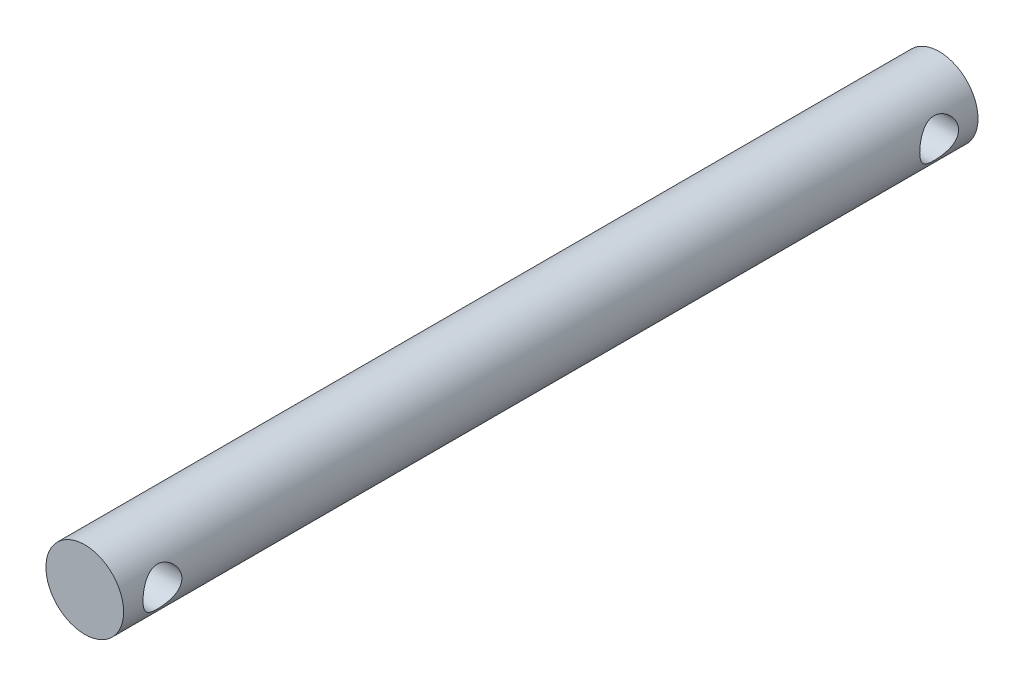
ISO-10303-21;
HEADER;
FILE_DESCRIPTION(('STEP AP214'),'2;1');
FILE_NAME('part.step','',(''),(''),'','','');
FILE_SCHEMA(('AUTOMOTIVE_DESIGN { 1 0 10303 214 1 1 1 1 }'));
ENDSEC;
DATA;
#1=APPLICATION_CONTEXT('core data for automotive mechanical design processes');
#2=APPLICATION_PROTOCOL_DEFINITION('international standard','automotive_design',2000,#1);
#3=PRODUCT_CONTEXT('',#1,'mechanical');
#4=PRODUCT('Part','Part','',(#3));
#5=PRODUCT_RELATED_PRODUCT_CATEGORY('part','',(#4));
#6=PRODUCT_DEFINITION_FORMATION('','',#4);
#7=PRODUCT_DEFINITION_CONTEXT('part definition',#1,'design');
#8=PRODUCT_DEFINITION('design','',#6,#7);
#9=PRODUCT_DEFINITION_SHAPE('','',#8);
#10=(LENGTH_UNIT() NAMED_UNIT(*) SI_UNIT(.MILLI.,.METRE.));
#11=(NAMED_UNIT(*) PLANE_ANGLE_UNIT() SI_UNIT($,.RADIAN.));
#12=(NAMED_UNIT(*) SI_UNIT($,.STERADIAN.) SOLID_ANGLE_UNIT());
#13=UNCERTAINTY_MEASURE_WITH_UNIT(LENGTH_MEASURE(1.E-05),#10,'distance_accuracy_value','');
#14=(GEOMETRIC_REPRESENTATION_CONTEXT(3) GLOBAL_UNCERTAINTY_ASSIGNED_CONTEXT((#13)) GLOBAL_UNIT_ASSIGNED_CONTEXT((#10,
#11,#12)) REPRESENTATION_CONTEXT('',''));
#15=CARTESIAN_POINT('',(0.,0.,0.));
#16=DIRECTION('',(0.,0.,1.));
#17=DIRECTION('',(1.,0.,0.));
#18=AXIS2_PLACEMENT_3D('',#15,#16,#17);
#19=CARTESIAN_POINT('',(0.,0.,33.));
#20=DIRECTION('',(0.,0.,-1.));
#21=DIRECTION('',(-1.,0.,0.));
#22=AXIS2_PLACEMENT_3D('',#19,#20,#21);
#23=CYLINDRICAL_SURFACE('',#22,3.);
#24=CARTESIAN_POINT('',(-3.,0.,-28.5));
#25=CARTESIAN_POINT('',(-2.99999570107562,-0.0788579444268505,-28.5000049534758));
#26=CARTESIAN_POINT('',(-2.99685736529635,-0.157809899546344,-28.5062551096816));
#27=CARTESIAN_POINT('',(-2.98461234055736,-0.313380352903345,-28.5309793205123));
#28=CARTESIAN_POINT('',(-2.97549431743379,-0.389994130070445,-28.5494765894967));
#29=CARTESIAN_POINT('',(-2.95224419105063,-0.538400317320674,-28.5977907129249));
#30=CARTESIAN_POINT('',(-2.93813158766306,-0.61021020440872,-28.6275635763719));
#31=CARTESIAN_POINT('',(-2.90618664773642,-0.747708925209898,-28.6973559320475));
#32=CARTESIAN_POINT('',(-2.88835460450288,-0.813398240985089,-28.7373746163733));
#33=CARTESIAN_POINT('',(-2.84934387387093,-0.941261726642865,-28.8292758742279));
#34=CARTESIAN_POINT('',(-2.82802798691306,-1.00298281668317,-28.8817297188595));
#35=CARTESIAN_POINT('',(-2.78489955370114,-1.11716916730047,-28.9957822188706));
#36=CARTESIAN_POINT('',(-2.76308664313552,-1.16962737466015,-29.0573877776587));
#37=CARTESIAN_POINT('',(-2.71948426796021,-1.26787800067542,-29.1937250242851));
#38=CARTESIAN_POINT('',(-2.69782780455198,-1.31283800332746,-29.2691041475189));
#39=CARTESIAN_POINT('',(-2.65928968158481,-1.38925234033605,-29.4275510039793));
#40=CARTESIAN_POINT('',(-2.64240461410484,-1.4207163224495,-29.5106131930841));
#41=CARTESIAN_POINT('',(-2.61686800556713,-1.46719866328289,-29.6769976581329));
#42=CARTESIAN_POINT('',(-2.6077840737557,-1.48308878562067,-29.7600066781011));
#43=CARTESIAN_POINT('',(-2.59772834922791,-1.50064048996327,-29.9279682566692));
#44=CARTESIAN_POINT('',(-2.59674854014932,-1.50231613255962,-30.0129188113067));
#45=CARTESIAN_POINT('',(-2.60266395385873,-1.49203093075845,-30.1714290364731));
#46=CARTESIAN_POINT('',(-2.6086314549302,-1.48167683930524,-30.2451360468346));
#47=CARTESIAN_POINT('',(-2.62614343100775,-1.4504097735854,-30.3895828640596));
#48=CARTESIAN_POINT('',(-2.63768968247664,-1.42949343584648,-30.460321717958));
#49=CARTESIAN_POINT('',(-2.66531214619111,-1.37731467057901,-30.5988436988485));
#50=CARTESIAN_POINT('',(-2.68148760995998,-1.345822600674,-30.6665195981787));
#51=CARTESIAN_POINT('',(-2.71655106422105,-1.27356253150201,-30.795951438885));
#52=CARTESIAN_POINT('',(-2.73544027170286,-1.2327903657187,-30.8577047034001));
#53=CARTESIAN_POINT('',(-2.77669736854929,-1.13709908236919,-30.9817818791148));
#54=CARTESIAN_POINT('',(-2.79920265355119,-1.08104168755392,-31.0431853103642));
#55=CARTESIAN_POINT('',(-2.84321434950611,-0.959333368112061,-31.1561031278864));
#56=CARTESIAN_POINT('',(-2.86472027938201,-0.893677884861429,-31.2076127880508));
#57=CARTESIAN_POINT('',(-2.90552980924446,-0.750774758747772,-31.3015284915446));
#58=CARTESIAN_POINT('',(-2.92468476243011,-0.673130387399112,-31.3434007086686));
#59=CARTESIAN_POINT('',(-2.95736821681863,-0.510699323233194,-31.4131455435645));
#60=CARTESIAN_POINT('',(-2.9709011841533,-0.425918364397913,-31.4410292775228));
#61=CARTESIAN_POINT('',(-2.98986500612153,-0.259149737491054,-31.479713105575));
#62=CARTESIAN_POINT('',(-2.99587407451965,-0.177512295822491,-31.4917368536202));
#63=CARTESIAN_POINT('',(-3.00109520188655,-0.0131693999240299,-31.5021970967017));
#64=CARTESIAN_POINT('',(-3.00031048081978,0.06953552980486,-31.5006400284592));
#65=CARTESIAN_POINT('',(-2.99236788380152,0.226849457978977,-31.4846899673719));
#66=CARTESIAN_POINT('',(-2.98570868532253,0.301589112074893,-31.471301200905));
#67=CARTESIAN_POINT('',(-2.9673325697226,0.44761033845291,-31.4336428921573));
#68=CARTESIAN_POINT('',(-2.95561509501618,0.518891528536629,-31.4093721503198));
#69=CARTESIAN_POINT('',(-2.92776377120382,0.658332912674358,-31.3500023003505));
#70=CARTESIAN_POINT('',(-2.91151322654446,0.726345595508704,-31.3146134248256));
#71=CARTESIAN_POINT('',(-2.87615961476126,0.855692042548907,-31.2343386965302));
#72=CARTESIAN_POINT('',(-2.85705533350408,0.917022944664887,-31.1894487981069));
#73=CARTESIAN_POINT('',(-2.81562332004297,1.03765153393382,-31.0863593620039));
#74=CARTESIAN_POINT('',(-2.79316327265249,1.09615811672854,-31.0272856973323));
#75=CARTESIAN_POINT('',(-2.7489358741323,1.20278448167829,-30.9001122730834));
#76=CARTESIAN_POINT('',(-2.7271690110007,1.25089707856781,-30.8320063217281));
#77=CARTESIAN_POINT('',(-2.68576788309734,1.33756187171853,-30.6845345187405));
#78=CARTESIAN_POINT('',(-2.66628794383591,1.37553824370037,-30.6047831008583));
#79=CARTESIAN_POINT('',(-2.63361108441202,1.43712423890206,-30.4387348986376));
#80=CARTESIAN_POINT('',(-2.62040607332625,1.46075237380053,-30.3524467102997));
#81=CARTESIAN_POINT('',(-2.60342251538703,1.49079253120031,-30.1846346656729));
#82=CARTESIAN_POINT('',(-2.59886075197597,1.49863949460818,-30.1034486198471));
#83=CARTESIAN_POINT('',(-2.59748031962405,1.50103373156431,-29.9408293992532));
#84=CARTESIAN_POINT('',(-2.60065829439585,1.49558676993487,-29.8593963468932));
#85=CARTESIAN_POINT('',(-2.61356793076615,1.47288918838997,-29.7067747476998));
#86=CARTESIAN_POINT('',(-2.62264641723987,1.45681247151455,-29.6353492947829));
#87=CARTESIAN_POINT('',(-2.64556524281479,1.41476303733662,-29.4962878208635));
#88=CARTESIAN_POINT('',(-2.65940711354502,1.38878713673989,-29.428653026862));
#89=CARTESIAN_POINT('',(-2.69142795546803,1.32572361795085,-29.2940627235202));
#90=CARTESIAN_POINT('',(-2.70983583593881,1.28800670672356,-29.2274581472565));
#91=CARTESIAN_POINT('',(-2.7485299745229,1.20322645745609,-29.1010881957281));
#92=CARTESIAN_POINT('',(-2.76881720693416,1.15615825686235,-29.0413264042183));
#93=CARTESIAN_POINT('',(-2.81193484737138,1.04730498999207,-28.922787026468));
#94=CARTESIAN_POINT('',(-2.83477474959942,0.984426634495897,-28.8650113464746));
#95=CARTESIAN_POINT('',(-2.87816628389896,0.849232209349801,-28.7606055248471));
#96=CARTESIAN_POINT('',(-2.89871667939292,0.776911084957801,-28.7139813907951));
#97=CARTESIAN_POINT('',(-2.93547014349806,0.623897395174423,-28.6331454559319));
#98=CARTESIAN_POINT('',(-2.95164144740899,0.543149255665101,-28.5990237461453));
#99=CARTESIAN_POINT('',(-2.9775201194848,0.376113151707135,-28.5452877483639));
#100=CARTESIAN_POINT('',(-2.98724585044602,0.289841699383654,-28.5256322297914));
#101=CARTESIAN_POINT('',(-2.99543192870217,0.168902919736346,-28.5091538833714));
#102=CARTESIAN_POINT('',(-2.99714048010376,0.13524281916235,-28.5057260387005));
#103=CARTESIAN_POINT('',(-2.99942545465223,0.067727597707639,-28.5011480017289));
#104=CARTESIAN_POINT('',(-3.00000184655071,0.0338724714699435,-28.4999978722947));
#105=CARTESIAN_POINT('',(-3.,0.,-28.5));
#106=B_SPLINE_CURVE_WITH_KNOTS('',3,(#24,#25,#26,#27,#28,#29,#30,#31,#32,#33,#34,#35,#36,#37,
#38,#39,#40,#41,#42,#43,#44,#45,#46,#47,#48,#49,#50,#51,#52,#53,#54,#55,#56,#57,#58,#59,#60,#61,
#62,#63,#64,#65,#66,#67,#68,#69,#70,#71,#72,#73,#74,#75,#76,#77,#78,#79,#80,#81,#82,#83,#84,#85,
#86,#87,#88,#89,#90,#91,#92,#93,#94,#95,#96,#97,#98,#99,#100,#101,#102,#103,#104,#105),
.UNSPECIFIED.,.T.,.F.,(4,2,2,2,2,2,2,2,2,2,2,2,2,2,2,2,2,2,2,2,2,2,2,2,2,2,2,2,2,2,2,2,2,2,2,2,
2,2,2,2,4),(0.,0.23643638613044,0.473322224563797,0.709293233238448,0.945245640872352,
1.19547263807714,1.44588935648106,1.7157258964613,1.98536921847422,2.23887018210344,
2.49212035993531,2.71508568613981,2.93812205888518,3.16635360252732,3.39468781890333,
3.65197412000819,3.90938301898031,4.17874533321662,4.44789325368421,4.6947493570702,
4.94148846767215,5.16910359759184,5.39674382446398,5.63089284041849,5.8651417612251,
6.12239415966629,6.37982382923149,6.64972023242589,6.91926767918177,7.16293961254571,
7.40650589797019,7.62686895373285,7.84730293182528,8.08254685170433,8.31791341715448,
8.58187864135759,8.84598575071871,9.11196020495292,9.37717362931726,9.47872920200877,
9.58028757766601),.UNSPECIFIED.);
#107=CARTESIAN_POINT('',(-3.,0.,-28.5));
#108=VERTEX_POINT('',#107);
#109=EDGE_CURVE('E38',#108,#108,#106,.T.);
#110=ORIENTED_EDGE('',*,*,#109,.T.);
#111=EDGE_LOOP('',(#110));
#112=FACE_BOUND('',#111,.T.);
#113=CARTESIAN_POINT('',(3.,0.,-31.5));
#114=CARTESIAN_POINT('',(2.99999570107562,-0.0788579444268504,-31.4999950465242));
#115=CARTESIAN_POINT('',(2.99685736529635,-0.157809899546344,-31.4937448903184));
#116=CARTESIAN_POINT('',(2.98461234055736,-0.313380352903345,-31.4690206794877));
#117=CARTESIAN_POINT('',(2.97549431743379,-0.389994130070445,-31.4505234105033));
#118=CARTESIAN_POINT('',(2.95224419105063,-0.538400317320674,-31.4022092870751));
#119=CARTESIAN_POINT('',(2.93813158766306,-0.610210204408721,-31.3724364236281));
#120=CARTESIAN_POINT('',(2.90618664773642,-0.7477089252099,-31.3026440679525));
#121=CARTESIAN_POINT('',(2.88835460450288,-0.813398240985089,-31.2626253836267));
#122=CARTESIAN_POINT('',(2.84934387387093,-0.941261726642865,-31.1707241257721));
#123=CARTESIAN_POINT('',(2.82802798691306,-1.00298281668317,-31.1182702811405));
#124=CARTESIAN_POINT('',(2.78489955370114,-1.11716916730047,-31.0042177811294));
#125=CARTESIAN_POINT('',(2.76308664313552,-1.16962737466015,-30.9426122223413));
#126=CARTESIAN_POINT('',(2.71948426796021,-1.26787800067542,-30.8062749757149));
#127=CARTESIAN_POINT('',(2.69782780455198,-1.31283800332746,-30.7308958524811));
#128=CARTESIAN_POINT('',(2.65928968158481,-1.38925234033605,-30.5724489960207));
#129=CARTESIAN_POINT('',(2.64240461410484,-1.4207163224495,-30.4893868069159));
#130=CARTESIAN_POINT('',(2.61686800556713,-1.46719866328289,-30.3230023418671));
#131=CARTESIAN_POINT('',(2.6077840737557,-1.48308878562067,-30.2399933218989));
#132=CARTESIAN_POINT('',(2.59772834922791,-1.50064048996327,-30.0720317433308));
#133=CARTESIAN_POINT('',(2.59674854014932,-1.50231613255962,-29.9870811886933));
#134=CARTESIAN_POINT('',(2.60266395385873,-1.49203093075845,-29.8285709635269));
#135=CARTESIAN_POINT('',(2.6086314549302,-1.48167683930524,-29.7548639531654));
#136=CARTESIAN_POINT('',(2.62614343100775,-1.4504097735854,-29.6104171359404));
#137=CARTESIAN_POINT('',(2.63768968247664,-1.42949343584648,-29.539678282042));
#138=CARTESIAN_POINT('',(2.66531214619111,-1.37731467057901,-29.4011563011515));
#139=CARTESIAN_POINT('',(2.68148760995998,-1.345822600674,-29.3334804018213));
#140=CARTESIAN_POINT('',(2.71655106422105,-1.27356253150201,-29.204048561115));
#141=CARTESIAN_POINT('',(2.73544027170286,-1.2327903657187,-29.1422952965999));
#142=CARTESIAN_POINT('',(2.77669736854929,-1.13709908236919,-29.0182181208852));
#143=CARTESIAN_POINT('',(2.79920265355119,-1.08104168755393,-28.9568146896358));
#144=CARTESIAN_POINT('',(2.84321434950611,-0.959333368112064,-28.8438968721136));
#145=CARTESIAN_POINT('',(2.86472027938201,-0.893677884861432,-28.7923872119492));
#146=CARTESIAN_POINT('',(2.90552980924446,-0.750774758747776,-28.6984715084554));
#147=CARTESIAN_POINT('',(2.92468476243011,-0.673130387399117,-28.6565992913314));
#148=CARTESIAN_POINT('',(2.95736821681863,-0.510699323233199,-28.5868544564355));
#149=CARTESIAN_POINT('',(2.9709011841533,-0.425918364397917,-28.5589707224772));
#150=CARTESIAN_POINT('',(2.98986500612153,-0.259149737491055,-28.520286894425));
#151=CARTESIAN_POINT('',(2.99587407451965,-0.177512295822491,-28.5082631463798));
#152=CARTESIAN_POINT('',(3.00109520188655,-0.0131693999240292,-28.4978029032983));
#153=CARTESIAN_POINT('',(3.00031048081978,0.0695355298048614,-28.4993599715408));
#154=CARTESIAN_POINT('',(2.99236788380152,0.226849457978979,-28.5153100326281));
#155=CARTESIAN_POINT('',(2.98570868532253,0.301589112074894,-28.528698799095));
#156=CARTESIAN_POINT('',(2.9673325697226,0.447610338452911,-28.5663571078427));
#157=CARTESIAN_POINT('',(2.95561509501618,0.51889152853663,-28.5906278496802));
#158=CARTESIAN_POINT('',(2.92776377120382,0.658332912674358,-28.6499976996495));
#159=CARTESIAN_POINT('',(2.91151322654446,0.726345595508704,-28.6853865751744));
#160=CARTESIAN_POINT('',(2.87615961476126,0.855692042548907,-28.7656613034698));
#161=CARTESIAN_POINT('',(2.85705533350407,0.917022944664887,-28.8105512018931));
#162=CARTESIAN_POINT('',(2.81562332004297,1.03765153393382,-28.9136406379961));
#163=CARTESIAN_POINT('',(2.79316327265249,1.09615811672854,-28.9727143026677));
#164=CARTESIAN_POINT('',(2.7489358741323,1.20278448167829,-29.0998877269166));
#165=CARTESIAN_POINT('',(2.7271690110007,1.25089707856781,-29.1679936782719));
#166=CARTESIAN_POINT('',(2.68576788309734,1.33756187171853,-29.3154654812595));
#167=CARTESIAN_POINT('',(2.66628794383591,1.37553824370037,-29.3952168991417));
#168=CARTESIAN_POINT('',(2.63361108441202,1.43712423890206,-29.5612651013624));
#169=CARTESIAN_POINT('',(2.62040607332625,1.46075237380053,-29.6475532897003));
#170=CARTESIAN_POINT('',(2.60342251538703,1.49079253120031,-29.8153653343271));
#171=CARTESIAN_POINT('',(2.59886075197597,1.49863949460818,-29.8965513801529));
#172=CARTESIAN_POINT('',(2.59748031962405,1.50103373156431,-30.0591706007468));
#173=CARTESIAN_POINT('',(2.60065829439585,1.49558676993487,-30.1406036531068));
#174=CARTESIAN_POINT('',(2.61356793076615,1.47288918838997,-30.2932252523002));
#175=CARTESIAN_POINT('',(2.62264641723987,1.45681247151455,-30.3646507052171));
#176=CARTESIAN_POINT('',(2.64556524281479,1.41476303733662,-30.5037121791366));
#177=CARTESIAN_POINT('',(2.65940711354502,1.38878713673989,-30.571346973138));
#178=CARTESIAN_POINT('',(2.69142795546803,1.32572361795085,-30.7059372764798));
#179=CARTESIAN_POINT('',(2.70983583593881,1.28800670672355,-30.7725418527435));
#180=CARTESIAN_POINT('',(2.7485299745229,1.20322645745609,-30.8989118042719));
#181=CARTESIAN_POINT('',(2.76881720693416,1.15615825686235,-30.9586735957817));
#182=CARTESIAN_POINT('',(2.81193484737138,1.04730498999207,-31.077212973532));
#183=CARTESIAN_POINT('',(2.83477474959942,0.984426634495898,-31.1349886535254));
#184=CARTESIAN_POINT('',(2.87816628389896,0.849232209349803,-31.2393944751529));
#185=CARTESIAN_POINT('',(2.89871667939292,0.776911084957803,-31.2860186092049));
#186=CARTESIAN_POINT('',(2.93547014349806,0.623897395174425,-31.3668545440681));
#187=CARTESIAN_POINT('',(2.95164144740899,0.5431492556651,-31.4009762538547));
#188=CARTESIAN_POINT('',(2.9775201194848,0.376113151707131,-31.4547122516361));
#189=CARTESIAN_POINT('',(2.98724585044602,0.289841699383651,-31.4743677702086));
#190=CARTESIAN_POINT('',(2.99543192870217,0.168902919736342,-31.4908461166286));
#191=CARTESIAN_POINT('',(2.99714048010376,0.135242819162347,-31.4942739612995));
#192=CARTESIAN_POINT('',(2.99942545465223,0.0677275977076375,-31.4988519982711));
#193=CARTESIAN_POINT('',(3.00000184655071,0.0338724714699427,-31.5000021277053));
#194=CARTESIAN_POINT('',(3.,0.,-31.5));
#195=B_SPLINE_CURVE_WITH_KNOTS('',3,(#113,#114,#115,#116,#117,#118,#119,#120,#121,#122,#123,
#124,#125,#126,#127,#128,#129,#130,#131,#132,#133,#134,#135,#136,#137,#138,#139,#140,#141,#142,
#143,#144,#145,#146,#147,#148,#149,#150,#151,#152,#153,#154,#155,#156,#157,#158,#159,#160,#161,
#162,#163,#164,#165,#166,#167,#168,#169,#170,#171,#172,#173,#174,#175,#176,#177,#178,#179,#180,
#181,#182,#183,#184,#185,#186,#187,#188,#189,#190,#191,#192,#193,#194),.UNSPECIFIED.,.T.,.F.,(4,
2,2,2,2,2,2,2,2,2,2,2,2,2,2,2,2,2,2,2,2,2,2,2,2,2,2,2,2,2,2,2,2,2,2,2,2,2,2,2,4),(0.,
0.236436386130439,0.473322224563797,0.709293233238447,0.945245640872352,1.19547263807714,
1.44588935648106,1.7157258964613,1.98536921847422,2.23887018210345,2.49212035993531,
2.71508568613981,2.93812205888518,3.16635360252732,3.39468781890333,3.65197412000818,
3.9093830189803,4.17874533321662,4.4478932536842,4.6947493570702,4.94148846767215,
5.16910359759184,5.39674382446399,5.63089284041849,5.8651417612251,6.1223941596663,
6.37982382923149,6.6497202324259,6.91926767918178,7.16293961254571,7.40650589797019,
7.62686895373286,7.84730293182529,8.08254685170433,8.31791341715448,8.58187864135759,
8.8459857507187,9.11196020495292,9.37717362931726,9.47872920200877,9.58028757766601),.UNSPECIFIED.);
#196=CARTESIAN_POINT('',(3.,0.,-31.5));
#197=VERTEX_POINT('',#196);
#198=EDGE_CURVE('E90',#197,#197,#195,.T.);
#199=ORIENTED_EDGE('',*,*,#198,.T.);
#200=EDGE_LOOP('',(#199));
#201=FACE_BOUND('',#200,.T.);
#202=CARTESIAN_POINT('',(-3.,0.,31.5));
#203=CARTESIAN_POINT('',(-2.99999570107562,-0.0788579444268506,31.4999950465242));
#204=CARTESIAN_POINT('',(-2.99685736529635,-0.157809899546344,31.4937448903184));
#205=CARTESIAN_POINT('',(-2.98461234055736,-0.313380352903345,31.4690206794877));
#206=CARTESIAN_POINT('',(-2.97549431743379,-0.389994130070445,31.4505234105033));
#207=CARTESIAN_POINT('',(-2.95224419105063,-0.538400317320674,31.4022092870751));
#208=CARTESIAN_POINT('',(-2.93813158766306,-0.61021020440872,31.3724364236281));
#209=CARTESIAN_POINT('',(-2.90618664773642,-0.7477089252099,31.3026440679525));
#210=CARTESIAN_POINT('',(-2.88835460450288,-0.813398240985091,31.2626253836267));
#211=CARTESIAN_POINT('',(-2.84934387387093,-0.941261726642867,31.1707241257721));
#212=CARTESIAN_POINT('',(-2.82802798691306,-1.00298281668317,31.1182702811405));
#213=CARTESIAN_POINT('',(-2.78489955370114,-1.11716916730047,31.0042177811295));
#214=CARTESIAN_POINT('',(-2.76308664313552,-1.16962737466016,30.9426122223413));
#215=CARTESIAN_POINT('',(-2.71948426796021,-1.26787800067542,30.8062749757149));
#216=CARTESIAN_POINT('',(-2.69782780455198,-1.31283800332746,30.7308958524811));
#217=CARTESIAN_POINT('',(-2.6592896815848,-1.38925234033605,30.5724489960207));
#218=CARTESIAN_POINT('',(-2.64240461410484,-1.42071632244951,30.4893868069159));
#219=CARTESIAN_POINT('',(-2.61686800556712,-1.46719866328289,30.3230023418671));
#220=CARTESIAN_POINT('',(-2.6077840737557,-1.48308878562067,30.2399933218989));
#221=CARTESIAN_POINT('',(-2.59772834922791,-1.50064048996328,30.0720317433308));
#222=CARTESIAN_POINT('',(-2.59674854014932,-1.50231613255962,29.9870811886933));
#223=CARTESIAN_POINT('',(-2.60266395385872,-1.49203093075845,29.828570963527));
#224=CARTESIAN_POINT('',(-2.6086314549302,-1.48167683930524,29.7548639531654));
#225=CARTESIAN_POINT('',(-2.62614343100775,-1.45040977358541,29.6104171359404));
#226=CARTESIAN_POINT('',(-2.63768968247664,-1.42949343584649,29.539678282042));
#227=CARTESIAN_POINT('',(-2.66531214619111,-1.37731467057902,29.4011563011515));
#228=CARTESIAN_POINT('',(-2.68148760995997,-1.345822600674,29.3334804018213));
#229=CARTESIAN_POINT('',(-2.71655106422105,-1.27356253150202,29.204048561115));
#230=CARTESIAN_POINT('',(-2.73544027170285,-1.23279036571871,29.1422952965999));
#231=CARTESIAN_POINT('',(-2.77669736854928,-1.1370990823692,29.0182181208852));
#232=CARTESIAN_POINT('',(-2.79920265355119,-1.08104168755394,28.9568146896358));
#233=CARTESIAN_POINT('',(-2.8432143495061,-0.959333368112075,28.8438968721137));
#234=CARTESIAN_POINT('',(-2.86472027938201,-0.893677884861442,28.7923872119492));
#235=CARTESIAN_POINT('',(-2.90552980924445,-0.750774758747787,28.6984715084554));
#236=CARTESIAN_POINT('',(-2.9246847624301,-0.673130387399129,28.6565992913314));
#237=CARTESIAN_POINT('',(-2.95736821681863,-0.510699323233211,28.5868544564355));
#238=CARTESIAN_POINT('',(-2.9709011841533,-0.425918364397929,28.5589707224773));
#239=CARTESIAN_POINT('',(-2.98986500612153,-0.259149737491068,28.520286894425));
#240=CARTESIAN_POINT('',(-2.99587407451965,-0.177512295822503,28.5082631463798));
#241=CARTESIAN_POINT('',(-3.00109520188655,-0.0131693999240407,28.4978029032983));
#242=CARTESIAN_POINT('',(-3.00031048081978,0.0695355298048501,28.4993599715408));
#243=CARTESIAN_POINT('',(-2.99236788380153,0.226849457978968,28.5153100326281));
#244=CARTESIAN_POINT('',(-2.98570868532253,0.301589112074882,28.528698799095));
#245=CARTESIAN_POINT('',(-2.96733256972261,0.447610338452899,28.5663571078427));
#246=CARTESIAN_POINT('',(-2.95561509501618,0.518891528536618,28.5906278496802));
#247=CARTESIAN_POINT('',(-2.92776377120382,0.658332912674347,28.6499976996495));
#248=CARTESIAN_POINT('',(-2.91151322654446,0.726345595508693,28.6853865751744));
#249=CARTESIAN_POINT('',(-2.87615961476127,0.855692042548896,28.7656613034699));
#250=CARTESIAN_POINT('',(-2.85705533350408,0.917022944664876,28.8105512018931));
#251=CARTESIAN_POINT('',(-2.81562332004297,1.03765153393381,28.9136406379961));
#252=CARTESIAN_POINT('',(-2.79316327265249,1.09615811672853,28.9727143026677));
#253=CARTESIAN_POINT('',(-2.7489358741323,1.20278448167827,29.0998877269166));
#254=CARTESIAN_POINT('',(-2.72716901100071,1.2508970785678,29.1679936782719));
#255=CARTESIAN_POINT('',(-2.68576788309735,1.33756187171852,29.3154654812595));
#256=CARTESIAN_POINT('',(-2.66628794383592,1.37553824370036,29.3952168991417));
#257=CARTESIAN_POINT('',(-2.63361108441203,1.43712423890205,29.5612651013624));
#258=CARTESIAN_POINT('',(-2.62040607332625,1.46075237380052,29.6475532897003));
#259=CARTESIAN_POINT('',(-2.60342251538703,1.4907925312003,29.8153653343271));
#260=CARTESIAN_POINT('',(-2.59886075197598,1.49863949460817,29.8965513801529));
#261=CARTESIAN_POINT('',(-2.59748031962405,1.5010337315643,30.0591706007468));
#262=CARTESIAN_POINT('',(-2.60065829439585,1.49558676993486,30.1406036531068));
#263=CARTESIAN_POINT('',(-2.61356793076615,1.47288918838996,30.2932252523002));
#264=CARTESIAN_POINT('',(-2.62264641723988,1.45681247151455,30.3646507052171));
#265=CARTESIAN_POINT('',(-2.64556524281479,1.41476303733661,30.5037121791365));
#266=CARTESIAN_POINT('',(-2.65940711354503,1.38878713673988,30.571346973138));
#267=CARTESIAN_POINT('',(-2.69142795546804,1.32572361795084,30.7059372764798));
#268=CARTESIAN_POINT('',(-2.70983583593881,1.28800670672355,30.7725418527435));
#269=CARTESIAN_POINT('',(-2.74852997452291,1.20322645745608,30.8989118042719));
#270=CARTESIAN_POINT('',(-2.76881720693416,1.15615825686234,30.9586735957817));
#271=CARTESIAN_POINT('',(-2.81193484737138,1.04730498999206,31.077212973532));
#272=CARTESIAN_POINT('',(-2.83477474959942,0.98442663449589,31.1349886535254));
#273=CARTESIAN_POINT('',(-2.87816628389896,0.849232209349795,31.2393944751529));
#274=CARTESIAN_POINT('',(-2.89871667939293,0.776911084957795,31.2860186092049));
#275=CARTESIAN_POINT('',(-2.93547014349806,0.623897395174419,31.3668545440681));
#276=CARTESIAN_POINT('',(-2.95164144740899,0.543149255665096,31.4009762538547));
#277=CARTESIAN_POINT('',(-2.9775201194848,0.376113151707129,31.4547122516361));
#278=CARTESIAN_POINT('',(-2.98724585044602,0.289841699383648,31.4743677702086));
#279=CARTESIAN_POINT('',(-2.99543192870217,0.168902919736341,31.4908461166286));
#280=CARTESIAN_POINT('',(-2.99714048010376,0.135242819162346,31.4942739612995));
#281=CARTESIAN_POINT('',(-2.99942545465223,0.0677275977076372,31.4988519982711));
#282=CARTESIAN_POINT('',(-3.00000184655071,0.0338724714699425,31.5000021277053));
#283=CARTESIAN_POINT('',(-3.,0.,31.5));
#284=B_SPLINE_CURVE_WITH_KNOTS('',3,(#202,#203,#204,#205,#206,#207,#208,#209,#210,#211,#212,
#213,#214,#215,#216,#217,#218,#219,#220,#221,#222,#223,#224,#225,#226,#227,#228,#229,#230,#231,
#232,#233,#234,#235,#236,#237,#238,#239,#240,#241,#242,#243,#244,#245,#246,#247,#248,#249,#250,
#251,#252,#253,#254,#255,#256,#257,#258,#259,#260,#261,#262,#263,#264,#265,#266,#267,#268,#269,
#270,#271,#272,#273,#274,#275,#276,#277,#278,#279,#280,#281,#282,#283),.UNSPECIFIED.,.T.,.F.,(4,
2,2,2,2,2,2,2,2,2,2,2,2,2,2,2,2,2,2,2,2,2,2,2,2,2,2,2,2,2,2,2,2,2,2,2,2,2,2,2,4),(0.,
0.236436386130439,0.473322224563797,0.709293233238447,0.945245640872352,1.19547263807714,
1.44588935648105,1.71572589646129,1.98536921847422,2.23887018210344,2.49212035993531,
2.71508568613981,2.93812205888518,3.16635360252731,3.39468781890332,3.65197412000818,
3.90938301898029,4.17874533321661,4.44789325368419,4.69474935707019,4.94148846767214,
5.16910359759183,5.39674382446398,5.63089284041848,5.86514176122509,6.12239415966628,
6.37982382923148,6.64972023242589,6.91926767918176,7.1629396125457,7.40650589797018,
7.62686895373284,7.84730293182527,8.08254685170431,8.31791341715446,8.58187864135757,
8.84598575071868,9.1119602049529,9.37717362931724,9.47872920200875,9.58028757766599),.UNSPECIFIED.);
#285=CARTESIAN_POINT('',(-3.,0.,31.5));
#286=VERTEX_POINT('',#285);
#287=EDGE_CURVE('E60',#286,#286,#284,.T.);
#288=ORIENTED_EDGE('',*,*,#287,.T.);
#289=EDGE_LOOP('',(#288));
#290=FACE_BOUND('',#289,.T.);
#291=CARTESIAN_POINT('',(3.,0.,28.5));
#292=CARTESIAN_POINT('',(2.99999570107562,-0.0788579444268575,28.5000049534758));
#293=CARTESIAN_POINT('',(2.99685736529635,-0.157809899546351,28.5062551096816));
#294=CARTESIAN_POINT('',(2.98461234055735,-0.313380352903351,28.5309793205123));
#295=CARTESIAN_POINT('',(2.97549431743379,-0.389994130070452,28.5494765894967));
#296=CARTESIAN_POINT('',(2.95224419105063,-0.53840031732068,28.5977907129249));
#297=CARTESIAN_POINT('',(2.93813158766306,-0.610210204408726,28.627563576372));
#298=CARTESIAN_POINT('',(2.90618664773642,-0.747708925209905,28.6973559320475));
#299=CARTESIAN_POINT('',(2.88835460450288,-0.813398240985095,28.7373746163733));
#300=CARTESIAN_POINT('',(2.84934387387093,-0.94126172664287,28.8292758742279));
#301=CARTESIAN_POINT('',(2.82802798691306,-1.00298281668317,28.8817297188595));
#302=CARTESIAN_POINT('',(2.78489955370114,-1.11716916730048,28.9957822188706));
#303=CARTESIAN_POINT('',(2.76308664313552,-1.16962737466016,29.0573877776587));
#304=CARTESIAN_POINT('',(2.71948426796021,-1.26787800067542,29.1937250242851));
#305=CARTESIAN_POINT('',(2.69782780455197,-1.31283800332746,29.2691041475189));
#306=CARTESIAN_POINT('',(2.6592896815848,-1.38925234033605,29.4275510039793));
#307=CARTESIAN_POINT('',(2.64240461410484,-1.42071632244951,29.5106131930841));
#308=CARTESIAN_POINT('',(2.61686800556712,-1.46719866328289,29.6769976581329));
#309=CARTESIAN_POINT('',(2.6077840737557,-1.48308878562067,29.7600066781011));
#310=CARTESIAN_POINT('',(2.59772834922791,-1.50064048996328,29.9279682566692));
#311=CARTESIAN_POINT('',(2.59674854014932,-1.50231613255962,30.0129188113067));
#312=CARTESIAN_POINT('',(2.60266395385872,-1.49203093075845,30.1714290364731));
#313=CARTESIAN_POINT('',(2.6086314549302,-1.48167683930524,30.2451360468346));
#314=CARTESIAN_POINT('',(2.62614343100775,-1.45040977358541,30.3895828640596));
#315=CARTESIAN_POINT('',(2.63768968247664,-1.42949343584649,30.460321717958));
#316=CARTESIAN_POINT('',(2.66531214619111,-1.37731467057901,30.5988436988485));
#317=CARTESIAN_POINT('',(2.68148760995997,-1.345822600674,30.6665195981787));
#318=CARTESIAN_POINT('',(2.71655106422105,-1.27356253150201,30.795951438885));
#319=CARTESIAN_POINT('',(2.73544027170285,-1.23279036571871,30.8577047034001));
#320=CARTESIAN_POINT('',(2.77669736854928,-1.13709908236919,30.9817818791148));
#321=CARTESIAN_POINT('',(2.79920265355119,-1.08104168755393,31.0431853103642));
#322=CARTESIAN_POINT('',(2.84321434950611,-0.959333368112067,31.1561031278864));
#323=CARTESIAN_POINT('',(2.86472027938201,-0.893677884861435,31.2076127880508));
#324=CARTESIAN_POINT('',(2.90552980924446,-0.750774758747778,31.3015284915446));
#325=CARTESIAN_POINT('',(2.92468476243011,-0.673130387399118,31.3434007086686));
#326=CARTESIAN_POINT('',(2.95736821681863,-0.510699323233201,31.4131455435645));
#327=CARTESIAN_POINT('',(2.9709011841533,-0.42591836439792,31.4410292775228));
#328=CARTESIAN_POINT('',(2.98986500612153,-0.259149737491061,31.479713105575));
#329=CARTESIAN_POINT('',(2.99587407451965,-0.177512295822497,31.4917368536202));
#330=CARTESIAN_POINT('',(3.00109520188655,-0.0131693999240364,31.5021970967017));
#331=CARTESIAN_POINT('',(3.00031048081978,0.0695355298048537,31.5006400284592));
#332=CARTESIAN_POINT('',(2.99236788380152,0.22684945797897,31.4846899673719));
#333=CARTESIAN_POINT('',(2.98570868532253,0.301589112074884,31.471301200905));
#334=CARTESIAN_POINT('',(2.96733256972261,0.447610338452902,31.4336428921573));
#335=CARTESIAN_POINT('',(2.95561509501618,0.518891528536622,31.4093721503198));
#336=CARTESIAN_POINT('',(2.92776377120382,0.658332912674353,31.3500023003505));
#337=CARTESIAN_POINT('',(2.91151322654446,0.7263455955087,31.3146134248256));
#338=CARTESIAN_POINT('',(2.87615961476127,0.855692042548902,31.2343386965301));
#339=CARTESIAN_POINT('',(2.85705533350408,0.91702294466488,31.1894487981069));
#340=CARTESIAN_POINT('',(2.81562332004297,1.03765153393382,31.0863593620039));
#341=CARTESIAN_POINT('',(2.79316327265249,1.09615811672853,31.0272856973323));
#342=CARTESIAN_POINT('',(2.7489358741323,1.20278448167828,30.9001122730834));
#343=CARTESIAN_POINT('',(2.72716901100071,1.2508970785678,30.8320063217281));
#344=CARTESIAN_POINT('',(2.68576788309734,1.33756187171852,30.6845345187405));
#345=CARTESIAN_POINT('',(2.66628794383592,1.37553824370036,30.6047831008583));
#346=CARTESIAN_POINT('',(2.63361108441203,1.43712423890205,30.4387348986376));
#347=CARTESIAN_POINT('',(2.62040607332625,1.46075237380052,30.3524467102997));
#348=CARTESIAN_POINT('',(2.60342251538703,1.4907925312003,30.1846346656729));
#349=CARTESIAN_POINT('',(2.59886075197598,1.49863949460817,30.1034486198471));
#350=CARTESIAN_POINT('',(2.59748031962405,1.5010337315643,29.9408293992532));
#351=CARTESIAN_POINT('',(2.60065829439585,1.49558676993486,29.8593963468932));
#352=CARTESIAN_POINT('',(2.61356793076615,1.47288918838996,29.7067747476999));
#353=CARTESIAN_POINT('',(2.62264641723988,1.45681247151454,29.6353492947829));
#354=CARTESIAN_POINT('',(2.64556524281479,1.41476303733661,29.4962878208635));
#355=CARTESIAN_POINT('',(2.65940711354503,1.38878713673988,29.428653026862));
#356=CARTESIAN_POINT('',(2.69142795546804,1.32572361795084,29.2940627235202));
#357=CARTESIAN_POINT('',(2.70983583593881,1.28800670672355,29.2274581472565));
#358=CARTESIAN_POINT('',(2.74852997452291,1.20322645745608,29.1010881957281));
#359=CARTESIAN_POINT('',(2.76881720693416,1.15615825686234,29.0413264042183));
#360=CARTESIAN_POINT('',(2.81193484737138,1.04730498999206,28.922787026468));
#361=CARTESIAN_POINT('',(2.83477474959942,0.984426634495887,28.8650113464746));
#362=CARTESIAN_POINT('',(2.87816628389896,0.849232209349792,28.7606055248471));
#363=CARTESIAN_POINT('',(2.89871667939293,0.776911084957792,28.7139813907951));
#364=CARTESIAN_POINT('',(2.93547014349806,0.623897395174414,28.6331454559319));
#365=CARTESIAN_POINT('',(2.95164144740899,0.543149255665091,28.5990237461453));
#366=CARTESIAN_POINT('',(2.9775201194848,0.376113151707124,28.5452877483639));
#367=CARTESIAN_POINT('',(2.98724585044602,0.289841699383644,28.5256322297914));
#368=CARTESIAN_POINT('',(2.99543192870217,0.168902919736336,28.5091538833714));
#369=CARTESIAN_POINT('',(2.99714048010376,0.135242819162341,28.5057260387005));
#370=CARTESIAN_POINT('',(2.99942545465223,0.0677275977076306,28.5011480017289));
#371=CARTESIAN_POINT('',(3.00000184655071,0.0338724714699356,28.4999978722947));
#372=CARTESIAN_POINT('',(3.,0.,28.5));
#373=B_SPLINE_CURVE_WITH_KNOTS('',3,(#291,#292,#293,#294,#295,#296,#297,#298,#299,#300,#301,
#302,#303,#304,#305,#306,#307,#308,#309,#310,#311,#312,#313,#314,#315,#316,#317,#318,#319,#320,
#321,#322,#323,#324,#325,#326,#327,#328,#329,#330,#331,#332,#333,#334,#335,#336,#337,#338,#339,
#340,#341,#342,#343,#344,#345,#346,#347,#348,#349,#350,#351,#352,#353,#354,#355,#356,#357,#358,
#359,#360,#361,#362,#363,#364,#365,#366,#367,#368,#369,#370,#371,#372),.UNSPECIFIED.,.T.,.F.,(4,
2,2,2,2,2,2,2,2,2,2,2,2,2,2,2,2,2,2,2,2,2,2,2,2,2,2,2,2,2,2,2,2,2,2,2,2,2,2,2,4),(0.,
0.236436386130438,0.473322224563797,0.709293233238448,0.945245640872352,1.19547263807713,
1.44588935648105,1.7157258964613,1.98536921847422,2.23887018210345,2.49212035993531,
2.71508568613981,2.93812205888518,3.16635360252731,3.39468781890333,3.65197412000818,
3.9093830189803,4.17874533321661,4.4478932536842,4.69474935707019,4.94148846767214,
5.16910359759183,5.39674382446398,5.63089284041849,5.86514176122509,6.12239415966629,
6.37982382923148,6.64972023242589,6.91926767918176,7.1629396125457,7.40650589797017,
7.62686895373284,7.84730293182527,8.08254685170431,8.31791341715446,8.58187864135757,
8.84598575071869,9.1119602049529,9.37717362931724,9.47872920200875,9.58028757766599),.UNSPECIFIED.);
#374=CARTESIAN_POINT('',(3.,0.,28.5));
#375=VERTEX_POINT('',#374);
#376=EDGE_CURVE('E53',#375,#375,#373,.T.);
#377=ORIENTED_EDGE('',*,*,#376,.T.);
#378=EDGE_LOOP('',(#377));
#379=FACE_BOUND('',#378,.T.);
#380=CARTESIAN_POINT('',(0.,0.,33.));
#381=DIRECTION('',(0.,0.,1.));
#382=DIRECTION('',(1.,0.,0.));
#383=AXIS2_PLACEMENT_3D('',#380,#381,#382);
#384=CIRCLE('',#383,3.);
#385=CARTESIAN_POINT('',(3.,0.,33.));
#386=VERTEX_POINT('',#385);
#387=EDGE_CURVE('E10',#386,#386,#384,.T.);
#388=ORIENTED_EDGE('',*,*,#387,.F.);
#389=EDGE_LOOP('',(#388));
#390=FACE_BOUND('',#389,.T.);
#391=CARTESIAN_POINT('',(0.,0.,-33.));
#392=DIRECTION('',(0.,0.,1.));
#393=DIRECTION('',(1.,0.,0.));
#394=AXIS2_PLACEMENT_3D('',#391,#392,#393);
#395=CIRCLE('',#394,3.);
#396=CARTESIAN_POINT('',(3.,0.,-33.));
#397=VERTEX_POINT('',#396);
#398=EDGE_CURVE('E46',#397,#397,#395,.T.);
#399=ORIENTED_EDGE('',*,*,#398,.T.);
#400=EDGE_LOOP('',(#399));
#401=FACE_BOUND('',#400,.T.);
#402=ADVANCED_FACE('F34',(#112,#201,#290,#379,#390,#401),#23,.T.);
#403=CARTESIAN_POINT('',(0.,0.,33.));
#404=DIRECTION('',(0.,0.,1.));
#405=DIRECTION('',(1.,0.,0.));
#406=AXIS2_PLACEMENT_3D('',#403,#404,#405);
#407=PLANE('',#406);
#408=ORIENTED_EDGE('',*,*,#387,.T.);
#409=EDGE_LOOP('',(#408));
#410=FACE_BOUND('',#409,.T.);
#411=ADVANCED_FACE('F72',(#410),#407,.T.);
#412=CARTESIAN_POINT('',(0.,0.,-33.));
#413=DIRECTION('',(0.,0.,1.));
#414=DIRECTION('',(1.,0.,0.));
#415=AXIS2_PLACEMENT_3D('',#412,#413,#414);
#416=PLANE('',#415);
#417=ORIENTED_EDGE('',*,*,#398,.F.);
#418=EDGE_LOOP('',(#417));
#419=FACE_BOUND('',#418,.T.);
#420=ADVANCED_FACE('F69',(#419),#416,.F.);
#421=CARTESIAN_POINT('',(-33.,0.,30.));
#422=DIRECTION('',(1.,0.,0.));
#423=DIRECTION('',(0.,0.,-1.));
#424=AXIS2_PLACEMENT_3D('',#421,#422,#423);
#425=CYLINDRICAL_SURFACE('',#424,1.5);
#426=ORIENTED_EDGE('',*,*,#376,.F.);
#427=EDGE_LOOP('',(#426));
#428=FACE_BOUND('',#427,.T.);
#429=ORIENTED_EDGE('',*,*,#287,.F.);
#430=EDGE_LOOP('',(#429));
#431=FACE_BOUND('',#430,.T.);
#432=ADVANCED_FACE('F64',(#428,#431),#425,.F.);
#433=CARTESIAN_POINT('',(-33.,0.,-30.));
#434=DIRECTION('',(1.,0.,0.));
#435=DIRECTION('',(0.,0.,-1.));
#436=AXIS2_PLACEMENT_3D('',#433,#434,#435);
#437=CYLINDRICAL_SURFACE('',#436,1.5);
#438=ORIENTED_EDGE('',*,*,#198,.F.);
#439=EDGE_LOOP('',(#438));
#440=FACE_BOUND('',#439,.T.);
#441=ORIENTED_EDGE('',*,*,#109,.F.);
#442=EDGE_LOOP('',(#441));
#443=FACE_BOUND('',#442,.T.);
#444=ADVANCED_FACE('F68',(#440,#443),#437,.F.);
#445=CLOSED_SHELL('',(#402,#411,#420,#432,#444));
#446=MANIFOLD_SOLID_BREP('B2',#445);
#447=ADVANCED_BREP_SHAPE_REPRESENTATION('',(#18,#446),#14);
#448=SHAPE_DEFINITION_REPRESENTATION(#9,#447);
ENDSEC;
END-ISO-10303-21;
